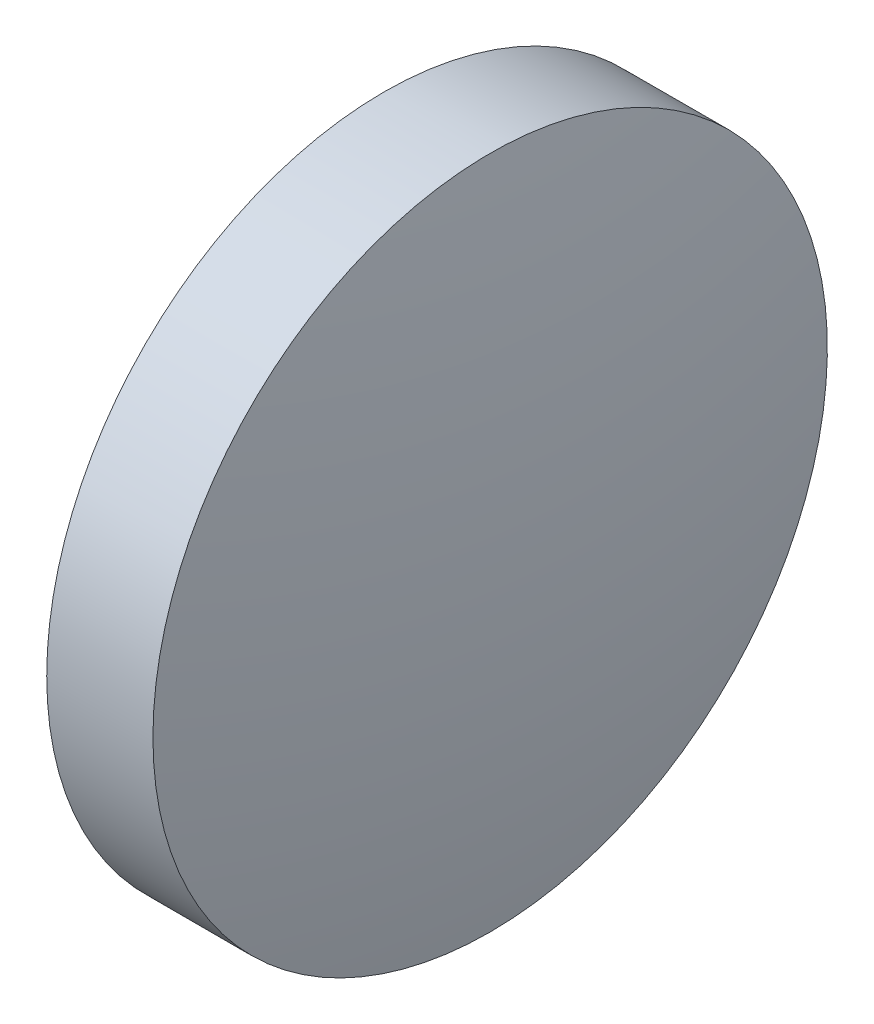
ISO-10303-21;
HEADER;
FILE_DESCRIPTION(('STEP AP214'),'2;1');
FILE_NAME('part.step','',(''),(''),'','','');
FILE_SCHEMA(('AUTOMOTIVE_DESIGN { 1 0 10303 214 1 1 1 1 }'));
ENDSEC;
DATA;
#1=APPLICATION_CONTEXT('core data for automotive mechanical design processes');
#2=APPLICATION_PROTOCOL_DEFINITION('international standard','automotive_design',2000,#1);
#3=PRODUCT_CONTEXT('',#1,'mechanical');
#4=PRODUCT('Part','Part','',(#3));
#5=PRODUCT_RELATED_PRODUCT_CATEGORY('part','',(#4));
#6=PRODUCT_DEFINITION_FORMATION('','',#4);
#7=PRODUCT_DEFINITION_CONTEXT('part definition',#1,'design');
#8=PRODUCT_DEFINITION('design','',#6,#7);
#9=PRODUCT_DEFINITION_SHAPE('','',#8);
#10=(LENGTH_UNIT() NAMED_UNIT(*) SI_UNIT(.MILLI.,.METRE.));
#11=(NAMED_UNIT(*) PLANE_ANGLE_UNIT() SI_UNIT($,.RADIAN.));
#12=(NAMED_UNIT(*) SI_UNIT($,.STERADIAN.) SOLID_ANGLE_UNIT());
#13=UNCERTAINTY_MEASURE_WITH_UNIT(LENGTH_MEASURE(1.E-05),#10,'distance_accuracy_value','');
#14=(GEOMETRIC_REPRESENTATION_CONTEXT(3) GLOBAL_UNCERTAINTY_ASSIGNED_CONTEXT((#13)) GLOBAL_UNIT_ASSIGNED_CONTEXT((#10,
#11,#12)) REPRESENTATION_CONTEXT('',''));
#15=CARTESIAN_POINT('',(0.,0.,0.));
#16=DIRECTION('',(0.,0.,1.));
#17=DIRECTION('',(1.,0.,0.));
#18=AXIS2_PLACEMENT_3D('',#15,#16,#17);
#19=CARTESIAN_POINT('',(75.5340843679168,24.3080565115924,0.));
#20=DIRECTION('',(-1.,0.,0.));
#21=DIRECTION('',(0.,1.,0.));
#22=AXIS2_PLACEMENT_3D('',#19,#20,#21);
#23=SPHERICAL_SURFACE('',#22,33.9049697662999);
#24=CARTESIAN_POINT('',(42.229062601617,24.3080565115924,0.));
#25=DIRECTION('',(-1.,0.,0.));
#26=DIRECTION('',(0.,0.,1.));
#27=AXIS2_PLACEMENT_3D('',#24,#25,#26);
#28=CIRCLE('',#27,6.35);
#29=CARTESIAN_POINT('',(42.229062601617,24.3080565115924,6.35));
#30=VERTEX_POINT('',#29);
#31=EDGE_CURVE('E46',#30,#30,#28,.T.);
#32=ORIENTED_EDGE('',*,*,#31,.T.);
#33=EDGE_LOOP('',(#32));
#34=FACE_BOUND('',#33,.T.);
#35=ADVANCED_FACE('F39',(#34),#23,.T.);
#36=CARTESIAN_POINT('',(10.9241094067462,24.3080565115924,0.));
#37=DIRECTION('',(-1.,0.,0.));
#38=DIRECTION('',(0.,-1.,0.));
#39=AXIS2_PLACEMENT_3D('',#36,#37,#38);
#40=SPHERICAL_SURFACE('',#39,33.9049697662994);
#41=CARTESIAN_POINT('',(44.2291311730456,24.3080565115924,0.));
#42=DIRECTION('',(-1.,0.,0.));
#43=DIRECTION('',(0.,0.,1.));
#44=AXIS2_PLACEMENT_3D('',#41,#42,#43);
#45=CIRCLE('',#44,6.35);
#46=CARTESIAN_POINT('',(44.2291311730456,24.3080565115924,6.35));
#47=VERTEX_POINT('',#46);
#48=EDGE_CURVE('E10',#47,#47,#45,.T.);
#49=ORIENTED_EDGE('',*,*,#48,.F.);
#50=EDGE_LOOP('',(#49));
#51=FACE_BOUND('',#50,.T.);
#52=ADVANCED_FACE('F56',(#51),#40,.T.);
#53=CARTESIAN_POINT('',(39.6527006754186,24.3080565115924,0.));
#54=DIRECTION('',(-1.,0.,0.));
#55=DIRECTION('',(0.,0.,1.));
#56=AXIS2_PLACEMENT_3D('',#53,#54,#55);
#57=CYLINDRICAL_SURFACE('',#56,6.35);
#58=ORIENTED_EDGE('',*,*,#48,.T.);
#59=EDGE_LOOP('',(#58));
#60=FACE_BOUND('',#59,.T.);
#61=ORIENTED_EDGE('',*,*,#31,.F.);
#62=EDGE_LOOP('',(#61));
#63=FACE_BOUND('',#62,.T.);
#64=ADVANCED_FACE('F54',(#60,#63),#57,.T.);
#65=CLOSED_SHELL('',(#35,#52,#64));
#66=MANIFOLD_SOLID_BREP('B2',#65);
#67=ADVANCED_BREP_SHAPE_REPRESENTATION('',(#18,#66),#14);
#68=SHAPE_DEFINITION_REPRESENTATION(#9,#67);
ENDSEC;
END-ISO-10303-21;
